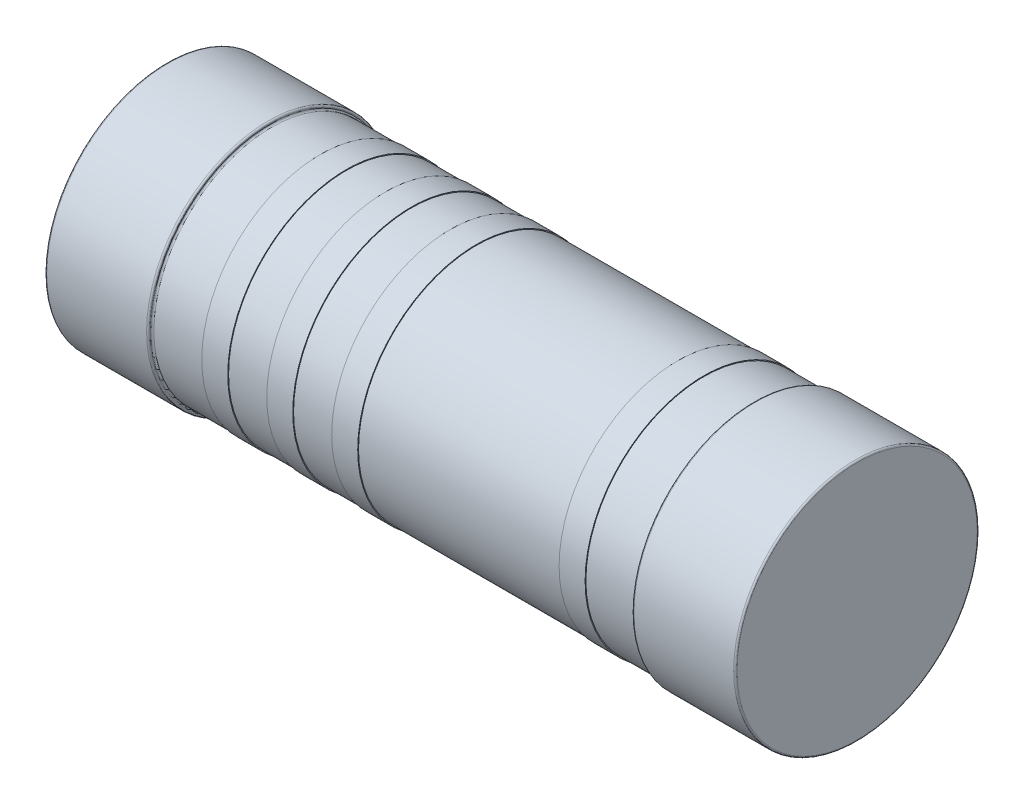
ISO-10303-21;
HEADER;
FILE_DESCRIPTION(('STEP AP214'),'2;1');
FILE_NAME('part.step','',(''),(''),'','','');
FILE_SCHEMA(('AUTOMOTIVE_DESIGN { 1 0 10303 214 1 1 1 1 }'));
ENDSEC;
DATA;
#1=APPLICATION_CONTEXT('core data for automotive mechanical design processes');
#2=APPLICATION_PROTOCOL_DEFINITION('international standard','automotive_design',2000,#1);
#3=PRODUCT_CONTEXT('',#1,'mechanical');
#4=PRODUCT('Part','Part','',(#3));
#5=PRODUCT_RELATED_PRODUCT_CATEGORY('part','',(#4));
#6=PRODUCT_DEFINITION_FORMATION('','',#4);
#7=PRODUCT_DEFINITION_CONTEXT('part definition',#1,'design');
#8=PRODUCT_DEFINITION('design','',#6,#7);
#9=PRODUCT_DEFINITION_SHAPE('','',#8);
#10=(LENGTH_UNIT() NAMED_UNIT(*) SI_UNIT(.MILLI.,.METRE.));
#11=(NAMED_UNIT(*) PLANE_ANGLE_UNIT() SI_UNIT($,.RADIAN.));
#12=(NAMED_UNIT(*) SI_UNIT($,.STERADIAN.) SOLID_ANGLE_UNIT());
#13=UNCERTAINTY_MEASURE_WITH_UNIT(LENGTH_MEASURE(1.E-05),#10,'distance_accuracy_value','');
#14=(GEOMETRIC_REPRESENTATION_CONTEXT(3) GLOBAL_UNCERTAINTY_ASSIGNED_CONTEXT((#13)) GLOBAL_UNIT_ASSIGNED_CONTEXT((#10,
#11,#12)) REPRESENTATION_CONTEXT('',''));
#15=CARTESIAN_POINT('',(0.,0.,0.));
#16=DIRECTION('',(0.,0.,1.));
#17=DIRECTION('',(1.,0.,0.));
#18=AXIS2_PLACEMENT_3D('',#15,#16,#17);
#19=CARTESIAN_POINT('',(-4.25,0.0200000000000001,0.));
#20=DIRECTION('',(-1.,0.,0.));
#21=DIRECTION('',(0.,0.,1.));
#22=AXIS2_PLACEMENT_3D('',#19,#20,#21);
#23=PLANE('',#22);
#24=CARTESIAN_POINT('',(-4.25,1.5,0.));
#25=DIRECTION('',(-1.,0.,0.));
#26=DIRECTION('',(0.,0.,1.));
#27=AXIS2_PLACEMENT_3D('',#24,#25,#26);
#28=CIRCLE('',#27,1.48);
#29=CARTESIAN_POINT('',(-4.25,1.5,1.48));
#30=VERTEX_POINT('',#29);
#31=EDGE_CURVE('E121',#30,#30,#28,.T.);
#32=ORIENTED_EDGE('',*,*,#31,.T.);
#33=EDGE_LOOP('',(#32));
#34=FACE_BOUND('',#33,.T.);
#35=ADVANCED_FACE('F33',(#34),#23,.T.);
#36=CARTESIAN_POINT('',(4.25,1.5,0.));
#37=DIRECTION('',(1.,0.,0.));
#38=DIRECTION('',(0.,0.,-1.));
#39=AXIS2_PLACEMENT_3D('',#36,#37,#38);
#40=PLANE('',#39);
#41=CARTESIAN_POINT('',(4.25,1.5,0.));
#42=DIRECTION('',(-1.,0.,0.));
#43=DIRECTION('',(0.,0.,1.));
#44=AXIS2_PLACEMENT_3D('',#41,#42,#43);
#45=CIRCLE('',#44,1.48);
#46=CARTESIAN_POINT('',(4.25,1.5,1.48));
#47=VERTEX_POINT('',#46);
#48=EDGE_CURVE('E10',#47,#47,#45,.T.);
#49=ORIENTED_EDGE('',*,*,#48,.F.);
#50=EDGE_LOOP('',(#49));
#51=FACE_BOUND('',#50,.T.);
#52=ADVANCED_FACE('F138',(#51),#40,.T.);
#53=CARTESIAN_POINT('',(4.23,1.5,0.));
#54=DIRECTION('',(-1.,0.,0.));
#55=DIRECTION('',(0.,0.,1.));
#56=AXIS2_PLACEMENT_3D('',#53,#54,#55);
#57=TOROIDAL_SURFACE('',#56,1.48,0.0200000000000001);
#58=ORIENTED_EDGE('',*,*,#48,.T.);
#59=EDGE_LOOP('',(#58));
#60=FACE_BOUND('',#59,.T.);
#61=CARTESIAN_POINT('',(4.23,1.5,0.));
#62=DIRECTION('',(-1.,0.,0.));
#63=DIRECTION('',(0.,0.,1.));
#64=AXIS2_PLACEMENT_3D('',#61,#62,#63);
#65=CIRCLE('',#64,1.5);
#66=CARTESIAN_POINT('',(4.23,1.5,1.5));
#67=VERTEX_POINT('',#66);
#68=EDGE_CURVE('E39',#67,#67,#65,.T.);
#69=ORIENTED_EDGE('',*,*,#68,.F.);
#70=EDGE_LOOP('',(#69));
#71=FACE_BOUND('',#70,.T.);
#72=ADVANCED_FACE('F142',(#60,#71),#57,.T.);
#73=CARTESIAN_POINT('',(-4.25,1.5,0.));
#74=DIRECTION('',(-1.,0.,0.));
#75=DIRECTION('',(0.,0.,1.));
#76=AXIS2_PLACEMENT_3D('',#73,#74,#75);
#77=CYLINDRICAL_SURFACE('',#76,1.5);
#78=ORIENTED_EDGE('',*,*,#68,.T.);
#79=EDGE_LOOP('',(#78));
#80=FACE_BOUND('',#79,.T.);
#81=CARTESIAN_POINT('',(3.,1.5,0.));
#82=DIRECTION('',(-1.,0.,0.));
#83=DIRECTION('',(0.,0.,1.));
#84=AXIS2_PLACEMENT_3D('',#81,#82,#83);
#85=CIRCLE('',#84,1.5);
#86=CARTESIAN_POINT('',(3.,1.5,1.5));
#87=VERTEX_POINT('',#86);
#88=EDGE_CURVE('E43',#87,#87,#85,.T.);
#89=ORIENTED_EDGE('',*,*,#88,.F.);
#90=EDGE_LOOP('',(#89));
#91=FACE_BOUND('',#90,.T.);
#92=ADVANCED_FACE('F147',(#80,#91),#77,.T.);
#93=CARTESIAN_POINT('',(3.,1.5,0.));
#94=DIRECTION('',(-1.,0.,0.));
#95=DIRECTION('',(0.,0.,1.));
#96=AXIS2_PLACEMENT_3D('',#93,#94,#95);
#97=TOROIDAL_SURFACE('',#96,1.48,0.0199999999999996);
#98=ORIENTED_EDGE('',*,*,#88,.T.);
#99=EDGE_LOOP('',(#98));
#100=FACE_BOUND('',#99,.T.);
#101=CARTESIAN_POINT('',(2.98,1.5,0.));
#102=DIRECTION('',(-1.,0.,0.));
#103=DIRECTION('',(0.,0.,1.));
#104=AXIS2_PLACEMENT_3D('',#101,#102,#103);
#105=CIRCLE('',#104,1.48);
#106=CARTESIAN_POINT('',(2.98,1.5,1.48));
#107=VERTEX_POINT('',#106);
#108=EDGE_CURVE('E47',#107,#107,#105,.T.);
#109=ORIENTED_EDGE('',*,*,#108,.F.);
#110=EDGE_LOOP('',(#109));
#111=FACE_BOUND('',#110,.T.);
#112=ADVANCED_FACE('F152',(#100,#111),#97,.T.);
#113=CARTESIAN_POINT('',(2.98,0.03,0.));
#114=DIRECTION('',(-1.,0.,0.));
#115=DIRECTION('',(0.,0.,1.));
#116=AXIS2_PLACEMENT_3D('',#113,#114,#115);
#117=PLANE('',#116);
#118=ORIENTED_EDGE('',*,*,#108,.T.);
#119=EDGE_LOOP('',(#118));
#120=FACE_BOUND('',#119,.T.);
#121=CARTESIAN_POINT('',(2.98,1.5,0.));
#122=DIRECTION('',(-1.,0.,0.));
#123=DIRECTION('',(0.,0.,1.));
#124=AXIS2_PLACEMENT_3D('',#121,#122,#123);
#125=CIRCLE('',#124,1.47);
#126=CARTESIAN_POINT('',(2.98,1.5,1.47));
#127=VERTEX_POINT('',#126);
#128=EDGE_CURVE('E52',#127,#127,#125,.T.);
#129=ORIENTED_EDGE('',*,*,#128,.F.);
#130=EDGE_LOOP('',(#129));
#131=FACE_BOUND('',#130,.T.);
#132=ADVANCED_FACE('F155',(#120,#131),#117,.T.);
#133=CARTESIAN_POINT('',(2.96,1.5,0.));
#134=DIRECTION('',(-1.,0.,0.));
#135=DIRECTION('',(0.,0.,1.));
#136=AXIS2_PLACEMENT_3D('',#133,#134,#135);
#137=TOROIDAL_SURFACE('',#136,1.47,0.0200000000000005);
#138=ORIENTED_EDGE('',*,*,#128,.T.);
#139=EDGE_LOOP('',(#138));
#140=FACE_BOUND('',#139,.T.);
#141=CARTESIAN_POINT('',(2.96,1.5,0.));
#142=DIRECTION('',(-1.,0.,0.));
#143=DIRECTION('',(0.,0.,1.));
#144=AXIS2_PLACEMENT_3D('',#141,#142,#143);
#145=CIRCLE('',#144,1.45);
#146=CARTESIAN_POINT('',(2.96,1.5,1.45));
#147=VERTEX_POINT('',#146);
#148=EDGE_CURVE('E55',#147,#147,#145,.T.);
#149=ORIENTED_EDGE('',*,*,#148,.F.);
#150=EDGE_LOOP('',(#149));
#151=FACE_BOUND('',#150,.T.);
#152=ADVANCED_FACE('F159',(#140,#151),#137,.F.);
#153=CARTESIAN_POINT('',(-4.25,1.5,0.));
#154=DIRECTION('',(-1.,0.,0.));
#155=DIRECTION('',(0.,0.,1.));
#156=AXIS2_PLACEMENT_3D('',#153,#154,#155);
#157=CYLINDRICAL_SURFACE('',#156,1.45);
#158=ORIENTED_EDGE('',*,*,#148,.T.);
#159=EDGE_LOOP('',(#158));
#160=FACE_BOUND('',#159,.T.);
#161=CARTESIAN_POINT('',(2.36,1.5,0.));
#162=DIRECTION('',(-1.,0.,0.));
#163=DIRECTION('',(0.,0.,1.));
#164=AXIS2_PLACEMENT_3D('',#161,#162,#163);
#165=CIRCLE('',#164,1.45);
#166=CARTESIAN_POINT('',(2.36,1.5,1.45));
#167=VERTEX_POINT('',#166);
#168=EDGE_CURVE('E58',#167,#167,#165,.T.);
#169=ORIENTED_EDGE('',*,*,#168,.F.);
#170=EDGE_LOOP('',(#169));
#171=FACE_BOUND('',#170,.T.);
#172=ADVANCED_FACE('F163',(#160,#171),#157,.T.);
#173=CARTESIAN_POINT('',(2.36,0.0500000000000007,0.));
#174=DIRECTION('',(1.,0.,0.));
#175=DIRECTION('',(0.,0.,-1.));
#176=AXIS2_PLACEMENT_3D('',#173,#174,#175);
#177=PLANE('',#176);
#178=ORIENTED_EDGE('',*,*,#168,.T.);
#179=EDGE_LOOP('',(#178));
#180=FACE_BOUND('',#179,.T.);
#181=CARTESIAN_POINT('',(2.36,1.5,0.));
#182=DIRECTION('',(-1.,0.,0.));
#183=DIRECTION('',(0.,0.,1.));
#184=AXIS2_PLACEMENT_3D('',#181,#182,#183);
#185=CIRCLE('',#184,1.46);
#186=CARTESIAN_POINT('',(2.36,1.5,1.46));
#187=VERTEX_POINT('',#186);
#188=EDGE_CURVE('E61',#187,#187,#185,.T.);
#189=ORIENTED_EDGE('',*,*,#188,.F.);
#190=EDGE_LOOP('',(#189));
#191=FACE_BOUND('',#190,.T.);
#192=ADVANCED_FACE('F167',(#180,#191),#177,.T.);
#193=CARTESIAN_POINT('',(-4.25,1.5,0.));
#194=DIRECTION('',(-1.,0.,0.));
#195=DIRECTION('',(0.,0.,1.));
#196=AXIS2_PLACEMENT_3D('',#193,#194,#195);
#197=CYLINDRICAL_SURFACE('',#196,1.46);
#198=ORIENTED_EDGE('',*,*,#188,.T.);
#199=EDGE_LOOP('',(#198));
#200=FACE_BOUND('',#199,.T.);
#201=CARTESIAN_POINT('',(2.04,1.5,0.));
#202=DIRECTION('',(-1.,0.,0.));
#203=DIRECTION('',(0.,0.,1.));
#204=AXIS2_PLACEMENT_3D('',#201,#202,#203);
#205=CIRCLE('',#204,1.46);
#206=CARTESIAN_POINT('',(2.04,1.5,1.46));
#207=VERTEX_POINT('',#206);
#208=EDGE_CURVE('E64',#207,#207,#205,.T.);
#209=ORIENTED_EDGE('',*,*,#208,.F.);
#210=EDGE_LOOP('',(#209));
#211=FACE_BOUND('',#210,.T.);
#212=ADVANCED_FACE('F171',(#200,#211),#197,.T.);
#213=CARTESIAN_POINT('',(2.04,0.0400000000000003,0.));
#214=DIRECTION('',(-1.,0.,0.));
#215=DIRECTION('',(0.,0.,1.));
#216=AXIS2_PLACEMENT_3D('',#213,#214,#215);
#217=PLANE('',#216);
#218=ORIENTED_EDGE('',*,*,#208,.T.);
#219=EDGE_LOOP('',(#218));
#220=FACE_BOUND('',#219,.T.);
#221=CARTESIAN_POINT('',(2.04,1.5,0.));
#222=DIRECTION('',(-1.,0.,0.));
#223=DIRECTION('',(0.,0.,1.));
#224=AXIS2_PLACEMENT_3D('',#221,#222,#223);
#225=CIRCLE('',#224,1.45);
#226=CARTESIAN_POINT('',(2.04,1.5,1.45));
#227=VERTEX_POINT('',#226);
#228=EDGE_CURVE('E67',#227,#227,#225,.T.);
#229=ORIENTED_EDGE('',*,*,#228,.F.);
#230=EDGE_LOOP('',(#229));
#231=FACE_BOUND('',#230,.T.);
#232=ADVANCED_FACE('F175',(#220,#231),#217,.T.);
#233=CARTESIAN_POINT('',(-4.25,1.5,0.));
#234=DIRECTION('',(-1.,0.,0.));
#235=DIRECTION('',(0.,0.,1.));
#236=AXIS2_PLACEMENT_3D('',#233,#234,#235);
#237=CYLINDRICAL_SURFACE('',#236,1.45);
#238=ORIENTED_EDGE('',*,*,#228,.T.);
#239=EDGE_LOOP('',(#238));
#240=FACE_BOUND('',#239,.T.);
#241=CARTESIAN_POINT('',(-0.44,1.5,0.));
#242=DIRECTION('',(-1.,0.,0.));
#243=DIRECTION('',(0.,0.,1.));
#244=AXIS2_PLACEMENT_3D('',#241,#242,#243);
#245=CIRCLE('',#244,1.45);
#246=CARTESIAN_POINT('',(-0.44,1.5,1.45));
#247=VERTEX_POINT('',#246);
#248=EDGE_CURVE('E70',#247,#247,#245,.T.);
#249=ORIENTED_EDGE('',*,*,#248,.F.);
#250=EDGE_LOOP('',(#249));
#251=FACE_BOUND('',#250,.T.);
#252=ADVANCED_FACE('F179',(#240,#251),#237,.T.);
#253=CARTESIAN_POINT('',(-0.44,0.04,0.));
#254=DIRECTION('',(1.,0.,0.));
#255=DIRECTION('',(0.,0.,-1.));
#256=AXIS2_PLACEMENT_3D('',#253,#254,#255);
#257=PLANE('',#256);
#258=ORIENTED_EDGE('',*,*,#248,.T.);
#259=EDGE_LOOP('',(#258));
#260=FACE_BOUND('',#259,.T.);
#261=CARTESIAN_POINT('',(-0.44,1.5,0.));
#262=DIRECTION('',(-1.,0.,0.));
#263=DIRECTION('',(0.,0.,1.));
#264=AXIS2_PLACEMENT_3D('',#261,#262,#263);
#265=CIRCLE('',#264,1.46);
#266=CARTESIAN_POINT('',(-0.44,1.5,1.46));
#267=VERTEX_POINT('',#266);
#268=EDGE_CURVE('E73',#267,#267,#265,.T.);
#269=ORIENTED_EDGE('',*,*,#268,.F.);
#270=EDGE_LOOP('',(#269));
#271=FACE_BOUND('',#270,.T.);
#272=ADVANCED_FACE('F183',(#260,#271),#257,.T.);
#273=CARTESIAN_POINT('',(-4.25,1.5,0.));
#274=DIRECTION('',(-1.,0.,0.));
#275=DIRECTION('',(0.,0.,1.));
#276=AXIS2_PLACEMENT_3D('',#273,#274,#275);
#277=CYLINDRICAL_SURFACE('',#276,1.46);
#278=ORIENTED_EDGE('',*,*,#268,.T.);
#279=EDGE_LOOP('',(#278));
#280=FACE_BOUND('',#279,.T.);
#281=CARTESIAN_POINT('',(-0.76,1.5,0.));
#282=DIRECTION('',(-1.,0.,0.));
#283=DIRECTION('',(0.,0.,1.));
#284=AXIS2_PLACEMENT_3D('',#281,#282,#283);
#285=CIRCLE('',#284,1.46);
#286=CARTESIAN_POINT('',(-0.76,1.5,1.46));
#287=VERTEX_POINT('',#286);
#288=EDGE_CURVE('E76',#287,#287,#285,.T.);
#289=ORIENTED_EDGE('',*,*,#288,.F.);
#290=EDGE_LOOP('',(#289));
#291=FACE_BOUND('',#290,.T.);
#292=ADVANCED_FACE('F187',(#280,#291),#277,.T.);
#293=CARTESIAN_POINT('',(-0.76,0.0399999999999999,0.));
#294=DIRECTION('',(-1.,0.,0.));
#295=DIRECTION('',(0.,0.,1.));
#296=AXIS2_PLACEMENT_3D('',#293,#294,#295);
#297=PLANE('',#296);
#298=ORIENTED_EDGE('',*,*,#288,.T.);
#299=EDGE_LOOP('',(#298));
#300=FACE_BOUND('',#299,.T.);
#301=CARTESIAN_POINT('',(-0.76,1.5,0.));
#302=DIRECTION('',(-1.,0.,0.));
#303=DIRECTION('',(0.,0.,1.));
#304=AXIS2_PLACEMENT_3D('',#301,#302,#303);
#305=CIRCLE('',#304,1.45);
#306=CARTESIAN_POINT('',(-0.76,1.5,1.45));
#307=VERTEX_POINT('',#306);
#308=EDGE_CURVE('E79',#307,#307,#305,.T.);
#309=ORIENTED_EDGE('',*,*,#308,.F.);
#310=EDGE_LOOP('',(#309));
#311=FACE_BOUND('',#310,.T.);
#312=ADVANCED_FACE('F191',(#300,#311),#297,.T.);
#313=CARTESIAN_POINT('',(-4.25,1.5,0.));
#314=DIRECTION('',(-1.,0.,0.));
#315=DIRECTION('',(0.,0.,1.));
#316=AXIS2_PLACEMENT_3D('',#313,#314,#315);
#317=CYLINDRICAL_SURFACE('',#316,1.45);
#318=ORIENTED_EDGE('',*,*,#308,.T.);
#319=EDGE_LOOP('',(#318));
#320=FACE_BOUND('',#319,.T.);
#321=CARTESIAN_POINT('',(-1.24,1.5,0.));
#322=DIRECTION('',(-1.,0.,0.));
#323=DIRECTION('',(0.,0.,1.));
#324=AXIS2_PLACEMENT_3D('',#321,#322,#323);
#325=CIRCLE('',#324,1.45);
#326=CARTESIAN_POINT('',(-1.24,1.5,1.45));
#327=VERTEX_POINT('',#326);
#328=EDGE_CURVE('E82',#327,#327,#325,.T.);
#329=ORIENTED_EDGE('',*,*,#328,.F.);
#330=EDGE_LOOP('',(#329));
#331=FACE_BOUND('',#330,.T.);
#332=ADVANCED_FACE('F195',(#320,#331),#317,.T.);
#333=CARTESIAN_POINT('',(-1.24,0.04,0.));
#334=DIRECTION('',(1.,0.,0.));
#335=DIRECTION('',(0.,0.,-1.));
#336=AXIS2_PLACEMENT_3D('',#333,#334,#335);
#337=PLANE('',#336);
#338=ORIENTED_EDGE('',*,*,#328,.T.);
#339=EDGE_LOOP('',(#338));
#340=FACE_BOUND('',#339,.T.);
#341=CARTESIAN_POINT('',(-1.24,1.5,0.));
#342=DIRECTION('',(-1.,0.,0.));
#343=DIRECTION('',(0.,0.,1.));
#344=AXIS2_PLACEMENT_3D('',#341,#342,#343);
#345=CIRCLE('',#344,1.46);
#346=CARTESIAN_POINT('',(-1.24,1.5,1.46));
#347=VERTEX_POINT('',#346);
#348=EDGE_CURVE('E85',#347,#347,#345,.T.);
#349=ORIENTED_EDGE('',*,*,#348,.F.);
#350=EDGE_LOOP('',(#349));
#351=FACE_BOUND('',#350,.T.);
#352=ADVANCED_FACE('F199',(#340,#351),#337,.T.);
#353=CARTESIAN_POINT('',(-4.25,1.5,0.));
#354=DIRECTION('',(-1.,0.,0.));
#355=DIRECTION('',(0.,0.,1.));
#356=AXIS2_PLACEMENT_3D('',#353,#354,#355);
#357=CYLINDRICAL_SURFACE('',#356,1.46);
#358=ORIENTED_EDGE('',*,*,#348,.T.);
#359=EDGE_LOOP('',(#358));
#360=FACE_BOUND('',#359,.T.);
#361=CARTESIAN_POINT('',(-1.56,1.5,0.));
#362=DIRECTION('',(-1.,0.,0.));
#363=DIRECTION('',(0.,0.,1.));
#364=AXIS2_PLACEMENT_3D('',#361,#362,#363);
#365=CIRCLE('',#364,1.46);
#366=CARTESIAN_POINT('',(-1.56,1.5,1.46));
#367=VERTEX_POINT('',#366);
#368=EDGE_CURVE('E88',#367,#367,#365,.T.);
#369=ORIENTED_EDGE('',*,*,#368,.F.);
#370=EDGE_LOOP('',(#369));
#371=FACE_BOUND('',#370,.T.);
#372=ADVANCED_FACE('F203',(#360,#371),#357,.T.);
#373=CARTESIAN_POINT('',(-1.56,0.05,0.));
#374=DIRECTION('',(-1.,0.,0.));
#375=DIRECTION('',(0.,0.,1.));
#376=AXIS2_PLACEMENT_3D('',#373,#374,#375);
#377=PLANE('',#376);
#378=ORIENTED_EDGE('',*,*,#368,.T.);
#379=EDGE_LOOP('',(#378));
#380=FACE_BOUND('',#379,.T.);
#381=CARTESIAN_POINT('',(-1.56,1.5,0.));
#382=DIRECTION('',(-1.,0.,0.));
#383=DIRECTION('',(0.,0.,1.));
#384=AXIS2_PLACEMENT_3D('',#381,#382,#383);
#385=CIRCLE('',#384,1.45);
#386=CARTESIAN_POINT('',(-1.56,1.5,1.45));
#387=VERTEX_POINT('',#386);
#388=EDGE_CURVE('E91',#387,#387,#385,.T.);
#389=ORIENTED_EDGE('',*,*,#388,.F.);
#390=EDGE_LOOP('',(#389));
#391=FACE_BOUND('',#390,.T.);
#392=ADVANCED_FACE('F207',(#380,#391),#377,.T.);
#393=CARTESIAN_POINT('',(-4.25,1.5,0.));
#394=DIRECTION('',(-1.,0.,0.));
#395=DIRECTION('',(0.,0.,1.));
#396=AXIS2_PLACEMENT_3D('',#393,#394,#395);
#397=CYLINDRICAL_SURFACE('',#396,1.45);
#398=ORIENTED_EDGE('',*,*,#388,.T.);
#399=EDGE_LOOP('',(#398));
#400=FACE_BOUND('',#399,.T.);
#401=CARTESIAN_POINT('',(-2.04,1.5,0.));
#402=DIRECTION('',(-1.,0.,0.));
#403=DIRECTION('',(0.,0.,1.));
#404=AXIS2_PLACEMENT_3D('',#401,#402,#403);
#405=CIRCLE('',#404,1.45);
#406=CARTESIAN_POINT('',(-2.04,1.5,1.45));
#407=VERTEX_POINT('',#406);
#408=EDGE_CURVE('E94',#407,#407,#405,.T.);
#409=ORIENTED_EDGE('',*,*,#408,.F.);
#410=EDGE_LOOP('',(#409));
#411=FACE_BOUND('',#410,.T.);
#412=ADVANCED_FACE('F211',(#400,#411),#397,.T.);
#413=CARTESIAN_POINT('',(-2.04,0.04,0.));
#414=DIRECTION('',(1.,0.,0.));
#415=DIRECTION('',(0.,0.,-1.));
#416=AXIS2_PLACEMENT_3D('',#413,#414,#415);
#417=PLANE('',#416);
#418=ORIENTED_EDGE('',*,*,#408,.T.);
#419=EDGE_LOOP('',(#418));
#420=FACE_BOUND('',#419,.T.);
#421=CARTESIAN_POINT('',(-2.04,1.5,0.));
#422=DIRECTION('',(-1.,0.,0.));
#423=DIRECTION('',(0.,0.,1.));
#424=AXIS2_PLACEMENT_3D('',#421,#422,#423);
#425=CIRCLE('',#424,1.46);
#426=CARTESIAN_POINT('',(-2.04,1.5,1.46));
#427=VERTEX_POINT('',#426);
#428=EDGE_CURVE('E97',#427,#427,#425,.T.);
#429=ORIENTED_EDGE('',*,*,#428,.F.);
#430=EDGE_LOOP('',(#429));
#431=FACE_BOUND('',#430,.T.);
#432=ADVANCED_FACE('F215',(#420,#431),#417,.T.);
#433=CARTESIAN_POINT('',(-4.25,1.5,0.));
#434=DIRECTION('',(-1.,0.,0.));
#435=DIRECTION('',(0.,0.,1.));
#436=AXIS2_PLACEMENT_3D('',#433,#434,#435);
#437=CYLINDRICAL_SURFACE('',#436,1.46);
#438=ORIENTED_EDGE('',*,*,#428,.T.);
#439=EDGE_LOOP('',(#438));
#440=FACE_BOUND('',#439,.T.);
#441=CARTESIAN_POINT('',(-2.36,1.5,0.));
#442=DIRECTION('',(-1.,0.,0.));
#443=DIRECTION('',(0.,0.,1.));
#444=AXIS2_PLACEMENT_3D('',#441,#442,#443);
#445=CIRCLE('',#444,1.46);
#446=CARTESIAN_POINT('',(-2.36,1.5,1.46));
#447=VERTEX_POINT('',#446);
#448=EDGE_CURVE('E100',#447,#447,#445,.T.);
#449=ORIENTED_EDGE('',*,*,#448,.F.);
#450=EDGE_LOOP('',(#449));
#451=FACE_BOUND('',#450,.T.);
#452=ADVANCED_FACE('F219',(#440,#451),#437,.T.);
#453=CARTESIAN_POINT('',(-2.36,0.05,0.));
#454=DIRECTION('',(-1.,0.,0.));
#455=DIRECTION('',(0.,0.,1.));
#456=AXIS2_PLACEMENT_3D('',#453,#454,#455);
#457=PLANE('',#456);
#458=ORIENTED_EDGE('',*,*,#448,.T.);
#459=EDGE_LOOP('',(#458));
#460=FACE_BOUND('',#459,.T.);
#461=CARTESIAN_POINT('',(-2.36,1.5,0.));
#462=DIRECTION('',(-1.,0.,0.));
#463=DIRECTION('',(0.,0.,1.));
#464=AXIS2_PLACEMENT_3D('',#461,#462,#463);
#465=CIRCLE('',#464,1.45);
#466=CARTESIAN_POINT('',(-2.36,1.5,1.45));
#467=VERTEX_POINT('',#466);
#468=EDGE_CURVE('E103',#467,#467,#465,.T.);
#469=ORIENTED_EDGE('',*,*,#468,.F.);
#470=EDGE_LOOP('',(#469));
#471=FACE_BOUND('',#470,.T.);
#472=ADVANCED_FACE('F223',(#460,#471),#457,.T.);
#473=CARTESIAN_POINT('',(-4.25,1.5,0.));
#474=DIRECTION('',(-1.,0.,0.));
#475=DIRECTION('',(0.,0.,1.));
#476=AXIS2_PLACEMENT_3D('',#473,#474,#475);
#477=CYLINDRICAL_SURFACE('',#476,1.45);
#478=ORIENTED_EDGE('',*,*,#468,.T.);
#479=EDGE_LOOP('',(#478));
#480=FACE_BOUND('',#479,.T.);
#481=CARTESIAN_POINT('',(-2.96,1.5,0.));
#482=DIRECTION('',(-1.,0.,0.));
#483=DIRECTION('',(0.,0.,1.));
#484=AXIS2_PLACEMENT_3D('',#481,#482,#483);
#485=CIRCLE('',#484,1.45);
#486=CARTESIAN_POINT('',(-2.96,1.5,1.45));
#487=VERTEX_POINT('',#486);
#488=EDGE_CURVE('E106',#487,#487,#485,.T.);
#489=ORIENTED_EDGE('',*,*,#488,.F.);
#490=EDGE_LOOP('',(#489));
#491=FACE_BOUND('',#490,.T.);
#492=ADVANCED_FACE('F227',(#480,#491),#477,.T.);
#493=CARTESIAN_POINT('',(-2.96,1.5,0.));
#494=DIRECTION('',(-1.,0.,0.));
#495=DIRECTION('',(0.,0.,1.));
#496=AXIS2_PLACEMENT_3D('',#493,#494,#495);
#497=TOROIDAL_SURFACE('',#496,1.47,0.0200000000000005);
#498=ORIENTED_EDGE('',*,*,#488,.T.);
#499=EDGE_LOOP('',(#498));
#500=FACE_BOUND('',#499,.T.);
#501=CARTESIAN_POINT('',(-2.98,1.5,0.));
#502=DIRECTION('',(-1.,0.,0.));
#503=DIRECTION('',(0.,0.,1.));
#504=AXIS2_PLACEMENT_3D('',#501,#502,#503);
#505=CIRCLE('',#504,1.47);
#506=CARTESIAN_POINT('',(-2.98,1.5,1.47));
#507=VERTEX_POINT('',#506);
#508=EDGE_CURVE('E109',#507,#507,#505,.T.);
#509=ORIENTED_EDGE('',*,*,#508,.F.);
#510=EDGE_LOOP('',(#509));
#511=FACE_BOUND('',#510,.T.);
#512=ADVANCED_FACE('F231',(#500,#511),#497,.F.);
#513=CARTESIAN_POINT('',(-2.98,0.02,0.));
#514=DIRECTION('',(1.,0.,0.));
#515=DIRECTION('',(0.,0.,-1.));
#516=AXIS2_PLACEMENT_3D('',#513,#514,#515);
#517=PLANE('',#516);
#518=ORIENTED_EDGE('',*,*,#508,.T.);
#519=EDGE_LOOP('',(#518));
#520=FACE_BOUND('',#519,.T.);
#521=CARTESIAN_POINT('',(-2.98,1.5,0.));
#522=DIRECTION('',(-1.,0.,0.));
#523=DIRECTION('',(0.,0.,1.));
#524=AXIS2_PLACEMENT_3D('',#521,#522,#523);
#525=CIRCLE('',#524,1.48);
#526=CARTESIAN_POINT('',(-2.98,1.5,1.48));
#527=VERTEX_POINT('',#526);
#528=EDGE_CURVE('E112',#527,#527,#525,.T.);
#529=ORIENTED_EDGE('',*,*,#528,.F.);
#530=EDGE_LOOP('',(#529));
#531=FACE_BOUND('',#530,.T.);
#532=ADVANCED_FACE('F235',(#520,#531),#517,.T.);
#533=CARTESIAN_POINT('',(-3.,1.5,0.));
#534=DIRECTION('',(-1.,0.,0.));
#535=DIRECTION('',(0.,0.,1.));
#536=AXIS2_PLACEMENT_3D('',#533,#534,#535);
#537=TOROIDAL_SURFACE('',#536,1.48,0.0199999999999996);
#538=ORIENTED_EDGE('',*,*,#528,.T.);
#539=EDGE_LOOP('',(#538));
#540=FACE_BOUND('',#539,.T.);
#541=CARTESIAN_POINT('',(-3.,1.5,0.));
#542=DIRECTION('',(-1.,0.,0.));
#543=DIRECTION('',(0.,0.,1.));
#544=AXIS2_PLACEMENT_3D('',#541,#542,#543);
#545=CIRCLE('',#544,1.5);
#546=CARTESIAN_POINT('',(-3.,1.5,1.5));
#547=VERTEX_POINT('',#546);
#548=EDGE_CURVE('E115',#547,#547,#545,.T.);
#549=ORIENTED_EDGE('',*,*,#548,.F.);
#550=EDGE_LOOP('',(#549));
#551=FACE_BOUND('',#550,.T.);
#552=ADVANCED_FACE('F134',(#540,#551),#537,.T.);
#553=CARTESIAN_POINT('',(-4.25,1.5,0.));
#554=DIRECTION('',(-1.,0.,0.));
#555=DIRECTION('',(0.,0.,1.));
#556=AXIS2_PLACEMENT_3D('',#553,#554,#555);
#557=CYLINDRICAL_SURFACE('',#556,1.5);
#558=ORIENTED_EDGE('',*,*,#548,.T.);
#559=EDGE_LOOP('',(#558));
#560=FACE_BOUND('',#559,.T.);
#561=CARTESIAN_POINT('',(-4.23,1.5,0.));
#562=DIRECTION('',(-1.,0.,0.));
#563=DIRECTION('',(0.,0.,1.));
#564=AXIS2_PLACEMENT_3D('',#561,#562,#563);
#565=CIRCLE('',#564,1.5);
#566=CARTESIAN_POINT('',(-4.23,1.5,1.5));
#567=VERTEX_POINT('',#566);
#568=EDGE_CURVE('E118',#567,#567,#565,.T.);
#569=ORIENTED_EDGE('',*,*,#568,.F.);
#570=EDGE_LOOP('',(#569));
#571=FACE_BOUND('',#570,.T.);
#572=ADVANCED_FACE('F128',(#560,#571),#557,.T.);
#573=CARTESIAN_POINT('',(-4.23,1.5,0.));
#574=DIRECTION('',(-1.,0.,0.));
#575=DIRECTION('',(0.,0.,1.));
#576=AXIS2_PLACEMENT_3D('',#573,#574,#575);
#577=TOROIDAL_SURFACE('',#576,1.48,0.0200000000000001);
#578=ORIENTED_EDGE('',*,*,#568,.T.);
#579=EDGE_LOOP('',(#578));
#580=FACE_BOUND('',#579,.T.);
#581=ORIENTED_EDGE('',*,*,#31,.F.);
#582=EDGE_LOOP('',(#581));
#583=FACE_BOUND('',#582,.T.);
#584=ADVANCED_FACE('F126',(#580,#583),#577,.T.);
#585=CLOSED_SHELL('',(#35,#52,#72,#92,#112,#132,#152,#172,#192,#212,#232,#252,#272,#292,#312,
#332,#352,#372,#392,#412,#432,#452,#472,#492,#512,#532,#552,#572,#584));
#586=MANIFOLD_SOLID_BREP('B2',#585);
#587=ADVANCED_BREP_SHAPE_REPRESENTATION('',(#18,#586),#14);
#588=SHAPE_DEFINITION_REPRESENTATION(#9,#587);
ENDSEC;
END-ISO-10303-21;
